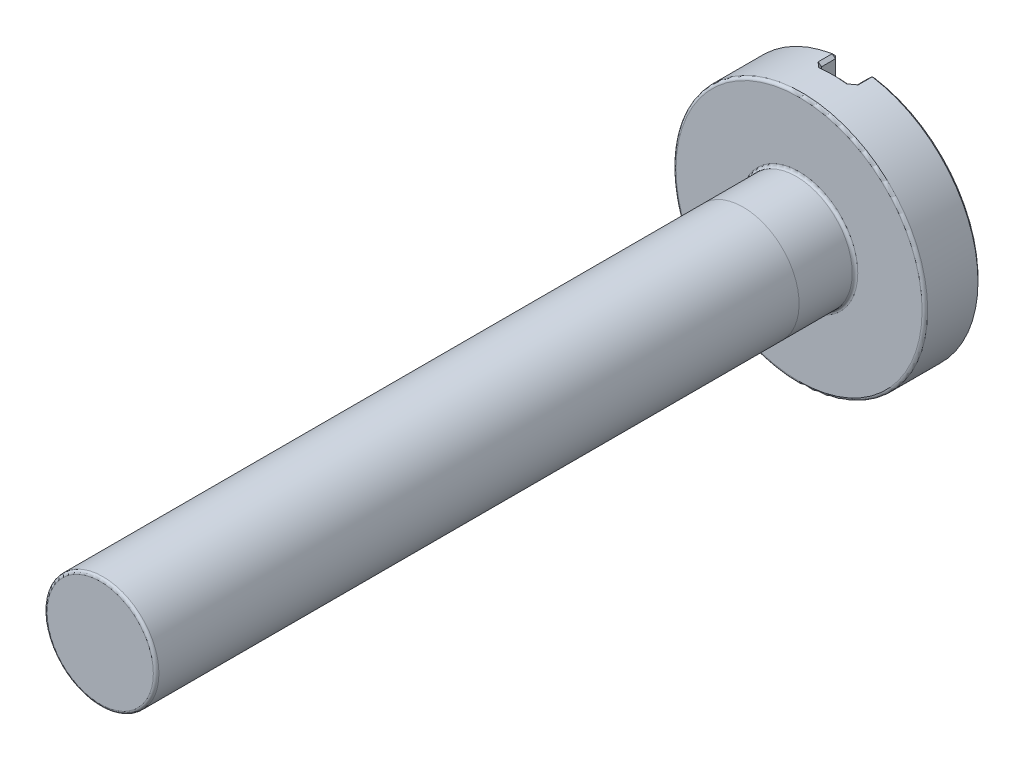
ISO-10303-21;
HEADER;
FILE_DESCRIPTION(('STEP AP214'),'2;1');
FILE_NAME('part.step','',(''),(''),'','','');
FILE_SCHEMA(('AUTOMOTIVE_DESIGN { 1 0 10303 214 1 1 1 1 }'));
ENDSEC;
DATA;
#1=APPLICATION_CONTEXT('core data for automotive mechanical design processes');
#2=APPLICATION_PROTOCOL_DEFINITION('international standard','automotive_design',2000,#1);
#3=PRODUCT_CONTEXT('',#1,'mechanical');
#4=PRODUCT('Part','Part','',(#3));
#5=PRODUCT_RELATED_PRODUCT_CATEGORY('part','',(#4));
#6=PRODUCT_DEFINITION_FORMATION('','',#4);
#7=PRODUCT_DEFINITION_CONTEXT('part definition',#1,'design');
#8=PRODUCT_DEFINITION('design','',#6,#7);
#9=PRODUCT_DEFINITION_SHAPE('','',#8);
#10=(LENGTH_UNIT() NAMED_UNIT(*) SI_UNIT(.MILLI.,.METRE.));
#11=(NAMED_UNIT(*) PLANE_ANGLE_UNIT() SI_UNIT($,.RADIAN.));
#12=(NAMED_UNIT(*) SI_UNIT($,.STERADIAN.) SOLID_ANGLE_UNIT());
#13=UNCERTAINTY_MEASURE_WITH_UNIT(LENGTH_MEASURE(1.E-05),#10,'distance_accuracy_value','');
#14=(GEOMETRIC_REPRESENTATION_CONTEXT(3) GLOBAL_UNCERTAINTY_ASSIGNED_CONTEXT((#13)) GLOBAL_UNIT_ASSIGNED_CONTEXT((#10,
#11,#12)) REPRESENTATION_CONTEXT('',''));
#15=CARTESIAN_POINT('',(0.,0.,0.));
#16=DIRECTION('',(0.,0.,1.));
#17=DIRECTION('',(1.,0.,0.));
#18=AXIS2_PLACEMENT_3D('',#15,#16,#17);
#19=CARTESIAN_POINT('',(0.,0.,12.5));
#20=DIRECTION('',(0.,0.,-1.));
#21=DIRECTION('',(-1.,0.,0.));
#22=AXIS2_PLACEMENT_3D('',#19,#20,#21);
#23=CYLINDRICAL_SURFACE('',#22,1.);
#24=CARTESIAN_POINT('',(0.,0.,12.45));
#25=DIRECTION('',(0.,0.,1.));
#26=DIRECTION('',(1.,0.,0.));
#27=AXIS2_PLACEMENT_3D('',#24,#25,#26);
#28=CIRCLE('',#27,1.);
#29=CARTESIAN_POINT('',(1.,0.,12.45));
#30=VERTEX_POINT('',#29);
#31=EDGE_CURVE('E55',#30,#30,#28,.F.);
#32=ORIENTED_EDGE('',*,*,#31,.T.);
#33=EDGE_LOOP('',(#32));
#34=FACE_BOUND('',#33,.T.);
#35=CARTESIAN_POINT('',(0.,0.,1.));
#36=DIRECTION('',(0.,0.,-1.));
#37=DIRECTION('',(0.,1.,0.));
#38=AXIS2_PLACEMENT_3D('',#35,#36,#37);
#39=CIRCLE('',#38,1.);
#40=CARTESIAN_POINT('',(0.,1.,1.));
#41=VERTEX_POINT('',#40);
#42=EDGE_CURVE('E11',#41,#41,#39,.T.);
#43=ORIENTED_EDGE('',*,*,#42,.F.);
#44=EDGE_LOOP('',(#43));
#45=FACE_BOUND('',#44,.T.);
#46=ADVANCED_FACE('F46',(#34,#45),#23,.T.);
#47=CARTESIAN_POINT('',(0.,0.,-1.));
#48=DIRECTION('',(0.,0.,1.));
#49=DIRECTION('',(1.,0.,0.));
#50=AXIS2_PLACEMENT_3D('',#47,#48,#49);
#51=CYLINDRICAL_SURFACE('',#50,2.25);
#52=CARTESIAN_POINT('',(0.,0.,-0.05));
#53=DIRECTION('',(0.,0.,1.));
#54=DIRECTION('',(1.,0.,0.));
#55=AXIS2_PLACEMENT_3D('',#52,#53,#54);
#56=CIRCLE('',#55,2.25);
#57=CARTESIAN_POINT('',(2.25,0.,-0.05));
#58=VERTEX_POINT('',#57);
#59=EDGE_CURVE('E514',#58,#58,#56,.F.);
#60=ORIENTED_EDGE('',*,*,#59,.T.);
#61=EDGE_LOOP('',(#60));
#62=FACE_BOUND('',#61,.T.);
#63=CARTESIAN_POINT('',(-0.357954545454545,2.22134385978138,-0.7));
#64=CARTESIAN_POINT('',(-0.349044313577281,2.22277959220945,-0.691081725524456));
#65=CARTESIAN_POINT('',(-0.340106008970925,2.22416500607063,-0.682183310951015));
#66=CARTESIAN_POINT('',(-0.322168315908917,2.22683406364462,-0.66443290328283));
#67=CARTESIAN_POINT('',(-0.313168927393422,2.2281177072577,-0.655580910233578));
#68=CARTESIAN_POINT('',(-0.288093679970526,2.2315384498966,-0.631080236997653));
#69=CARTESIAN_POINT('',(-0.271946710820839,2.23356468320811,-0.615488807873462));
#70=CARTESIAN_POINT('',(-0.255681818186013,2.23542541988267,-0.600000000002841));
#71=B_SPLINE_CURVE_WITH_KNOTS('',3,(#63,#64,#65,#66,#67,#68,#69,#70),.UNSPECIFIED.,.F.,.F.,(4,2,
2,4),(0.,0.0380643972705644,0.0761288318363076,0.143736873551843),.UNSPECIFIED.);
#72=CARTESIAN_POINT('',(-0.357954545454545,2.22134385978138,-0.7));
#73=VERTEX_POINT('',#72);
#74=CARTESIAN_POINT('',(-0.255681818181818,2.23542541988124,-0.6));
#75=VERTEX_POINT('',#74);
#76=EDGE_CURVE('E261',#73,#75,#71,.T.);
#77=ORIENTED_EDGE('',*,*,#76,.F.);
#78=DIRECTION('',(0.,0.,1.));
#79=VECTOR('',#78,1.);
#80=CARTESIAN_POINT('',(-0.357954545454545,2.22134385978138,-1.));
#81=LINE('',#80,#79);
#82=CARTESIAN_POINT('',(-0.357954545454545,2.22134385978138,-0.95));
#83=VERTEX_POINT('',#82);
#84=EDGE_CURVE('E259',#73,#83,#81,.F.);
#85=ORIENTED_EDGE('',*,*,#84,.T.);
#86=CARTESIAN_POINT('',(0.,0.,-0.95));
#87=DIRECTION('',(0.,0.,1.));
#88=DIRECTION('',(1.,0.,0.));
#89=AXIS2_PLACEMENT_3D('',#86,#87,#88);
#90=CIRCLE('',#89,2.25);
#91=CARTESIAN_POINT('',(-0.357954545454545,-2.22134385978138,-0.95));
#92=VERTEX_POINT('',#91);
#93=EDGE_CURVE('E255',#83,#92,#90,.T.);
#94=ORIENTED_EDGE('',*,*,#93,.T.);
#95=DIRECTION('',(0.,0.,1.));
#96=VECTOR('',#95,1.);
#97=CARTESIAN_POINT('',(-0.357954545454545,-2.22134385978138,-1.));
#98=LINE('',#97,#96);
#99=CARTESIAN_POINT('',(-0.357954545454545,-2.22134385978138,-0.7));
#100=VERTEX_POINT('',#99);
#101=EDGE_CURVE('E155',#92,#100,#98,.T.);
#102=ORIENTED_EDGE('',*,*,#101,.T.);
#103=CARTESIAN_POINT('',(-0.255681818181818,-2.23542541988124,-0.6));
#104=CARTESIAN_POINT('',(-0.264839427943543,-2.23437790052862,-0.608719796943994));
#105=CARTESIAN_POINT('',(-0.273959417330191,-2.23327784719118,-0.617472569925155));
#106=CARTESIAN_POINT('',(-0.29212937173172,-2.23097387990717,-0.635036917762392));
#107=CARTESIAN_POINT('',(-0.301179336862998,-2.22976996613328,-0.643848492520682));
#108=CARTESIAN_POINT('',(-0.326213414850236,-2.22628523492306,-0.668382417252336));
#109=CARTESIAN_POINT('',(-0.342127740146839,-2.22389382114135,-0.68416044499739));
#110=CARTESIAN_POINT('',(-0.357954545456661,-2.22134385978236,-0.700000000001358));
#111=B_SPLINE_CURVE_WITH_KNOTS('',3,(#103,#104,#105,#106,#107,#108,#109,#110),.UNSPECIFIED.,.F.,
.F.,(4,2,2,4),(0.,0.0380645508803724,0.0761290384749272,0.143736997088426),.UNSPECIFIED.);
#112=CARTESIAN_POINT('',(-0.255681818181818,-2.23542541988124,-0.6));
#113=VERTEX_POINT('',#112);
#114=EDGE_CURVE('E247',#113,#100,#111,.T.);
#115=ORIENTED_EDGE('',*,*,#114,.F.);
#116=CARTESIAN_POINT('',(0.,0.,-0.6));
#117=DIRECTION('',(0.,0.,-1.));
#118=DIRECTION('',(-1.,0.,0.));
#119=AXIS2_PLACEMENT_3D('',#116,#117,#118);
#120=CIRCLE('',#119,2.25);
#121=CARTESIAN_POINT('',(0.255681818181818,-2.23542541988124,-0.6));
#122=VERTEX_POINT('',#121);
#123=EDGE_CURVE('E203',#113,#122,#120,.F.);
#124=ORIENTED_EDGE('',*,*,#123,.T.);
#125=CARTESIAN_POINT('',(0.357954545454545,-2.22134385978138,-0.7));
#126=CARTESIAN_POINT('',(0.349044313577281,-2.22277959220945,-0.691081725524456));
#127=CARTESIAN_POINT('',(0.340106008970925,-2.22416500607063,-0.682183310951015));
#128=CARTESIAN_POINT('',(0.322168315908917,-2.22683406364462,-0.66443290328283));
#129=CARTESIAN_POINT('',(0.313168927393422,-2.2281177072577,-0.655580910233578));
#130=CARTESIAN_POINT('',(0.288093679970526,-2.2315384498966,-0.631080236997653));
#131=CARTESIAN_POINT('',(0.271946710820839,-2.23356468320811,-0.615488807873462));
#132=CARTESIAN_POINT('',(0.255681818186013,-2.23542541988267,-0.600000000002841));
#133=B_SPLINE_CURVE_WITH_KNOTS('',3,(#125,#126,#127,#128,#129,#130,#131,#132),.UNSPECIFIED.,.F.,
.F.,(4,2,2,4),(0.,0.0380643972705644,0.0761288318363076,0.143736873551843),.UNSPECIFIED.);
#134=CARTESIAN_POINT('',(0.357954545454545,-2.22134385978138,-0.7));
#135=VERTEX_POINT('',#134);
#136=EDGE_CURVE('E194',#135,#122,#133,.T.);
#137=ORIENTED_EDGE('',*,*,#136,.F.);
#138=DIRECTION('',(0.,0.,1.));
#139=VECTOR('',#138,1.);
#140=CARTESIAN_POINT('',(0.357954545454545,-2.22134385978138,-1.));
#141=LINE('',#140,#139);
#142=CARTESIAN_POINT('',(0.357954545454545,-2.22134385978138,-0.95));
#143=VERTEX_POINT('',#142);
#144=EDGE_CURVE('E192',#135,#143,#141,.F.);
#145=ORIENTED_EDGE('',*,*,#144,.T.);
#146=CARTESIAN_POINT('',(0.,0.,-0.95));
#147=DIRECTION('',(0.,0.,1.));
#148=DIRECTION('',(1.,0.,0.));
#149=AXIS2_PLACEMENT_3D('',#146,#147,#148);
#150=CIRCLE('',#149,2.25);
#151=CARTESIAN_POINT('',(0.357954545454545,2.22134385978138,-0.95));
#152=VERTEX_POINT('',#151);
#153=EDGE_CURVE('E185',#143,#152,#150,.T.);
#154=ORIENTED_EDGE('',*,*,#153,.T.);
#155=DIRECTION('',(0.,0.,1.));
#156=VECTOR('',#155,1.);
#157=CARTESIAN_POINT('',(0.357954545454545,2.22134385978138,-1.));
#158=LINE('',#157,#156);
#159=CARTESIAN_POINT('',(0.357954545454545,2.22134385978138,-0.7));
#160=VERTEX_POINT('',#159);
#161=EDGE_CURVE('E190',#152,#160,#158,.T.);
#162=ORIENTED_EDGE('',*,*,#161,.T.);
#163=CARTESIAN_POINT('',(0.255681818181818,2.23542541988124,-0.6));
#164=CARTESIAN_POINT('',(0.264839427943543,2.23437790052862,-0.608719796943994));
#165=CARTESIAN_POINT('',(0.273959417330191,2.23327784719118,-0.617472569925155));
#166=CARTESIAN_POINT('',(0.29212937173172,2.23097387990717,-0.635036917762392));
#167=CARTESIAN_POINT('',(0.301179336862998,2.22976996613328,-0.643848492520682));
#168=CARTESIAN_POINT('',(0.326213414850236,2.22628523492306,-0.668382417252336));
#169=CARTESIAN_POINT('',(0.342127740146839,2.22389382114135,-0.68416044499739));
#170=CARTESIAN_POINT('',(0.357954545456661,2.22134385978236,-0.700000000001358));
#171=B_SPLINE_CURVE_WITH_KNOTS('',3,(#163,#164,#165,#166,#167,#168,#169,#170),.UNSPECIFIED.,.F.,
.F.,(4,2,2,4),(0.,0.0380645508803724,0.0761290384749272,0.143736997088426),.UNSPECIFIED.);
#172=CARTESIAN_POINT('',(0.255681818181818,2.23542541988124,-0.6));
#173=VERTEX_POINT('',#172);
#174=EDGE_CURVE('E240',#173,#160,#171,.T.);
#175=ORIENTED_EDGE('',*,*,#174,.F.);
#176=CARTESIAN_POINT('',(0.,0.,-0.6));
#177=DIRECTION('',(0.,0.,-1.));
#178=DIRECTION('',(-1.,0.,0.));
#179=AXIS2_PLACEMENT_3D('',#176,#177,#178);
#180=CIRCLE('',#179,2.25);
#181=EDGE_CURVE('E257',#173,#75,#180,.F.);
#182=ORIENTED_EDGE('',*,*,#181,.T.);
#183=EDGE_LOOP('',(#77,#85,#94,#102,#115,#124,#137,#145,#154,#162,#175,#182));
#184=FACE_BOUND('',#183,.T.);
#185=ADVANCED_FACE('F205',(#62,#184),#51,.T.);
#186=CARTESIAN_POINT('',(0.,0.,-1.));
#187=DIRECTION('',(0.,0.,1.));
#188=DIRECTION('',(1.,0.,0.));
#189=AXIS2_PLACEMENT_3D('',#186,#187,#188);
#190=PLANE('',#189);
#191=CARTESIAN_POINT('',(0.,0.,-1.));
#192=DIRECTION('',(0.,0.,1.));
#193=DIRECTION('',(1.,0.,0.));
#194=AXIS2_PLACEMENT_3D('',#191,#192,#193);
#195=CIRCLE('',#194,2.2);
#196=CARTESIAN_POINT('',(0.35,2.17198066289735,-1.));
#197=VERTEX_POINT('',#196);
#198=CARTESIAN_POINT('',(0.35,-2.17198066289735,-1.));
#199=VERTEX_POINT('',#198);
#200=EDGE_CURVE('E61',#197,#199,#195,.F.);
#201=ORIENTED_EDGE('',*,*,#200,.T.);
#202=DIRECTION('',(0.,1.,0.));
#203=VECTOR('',#202,1.);
#204=CARTESIAN_POINT('',(0.35,0.,-1.));
#205=LINE('',#204,#203);
#206=EDGE_CURVE('E530',#199,#197,#205,.T.);
#207=ORIENTED_EDGE('',*,*,#206,.T.);
#208=EDGE_LOOP('',(#201,#207));
#209=FACE_BOUND('',#208,.T.);
#210=ADVANCED_FACE('F494',(#209),#190,.F.);
#211=ORIENTED_EDGE('',*,*,#42,.T.);
#212=EDGE_LOOP('',(#211));
#213=FACE_BOUND('',#212,.T.);
#214=CARTESIAN_POINT('',(0.,0.,0.0499999999999997));
#215=DIRECTION('',(0.,0.,1.));
#216=DIRECTION('',(1.,0.,0.));
#217=AXIS2_PLACEMENT_3D('',#214,#215,#216);
#218=CIRCLE('',#217,1.);
#219=CARTESIAN_POINT('',(1.,0.,0.0499999999999997));
#220=VERTEX_POINT('',#219);
#221=EDGE_CURVE('E512',#220,#220,#218,.T.);
#222=ORIENTED_EDGE('',*,*,#221,.T.);
#223=EDGE_LOOP('',(#222));
#224=FACE_BOUND('',#223,.T.);
#225=ADVANCED_FACE('F218',(#213,#224),#23,.T.);
#226=CARTESIAN_POINT('',(0.,0.,12.5));
#227=DIRECTION('',(0.,0.,1.));
#228=DIRECTION('',(1.,0.,0.));
#229=AXIS2_PLACEMENT_3D('',#226,#227,#228);
#230=PLANE('',#229);
#231=CARTESIAN_POINT('',(0.,0.,12.5));
#232=DIRECTION('',(0.,0.,1.));
#233=DIRECTION('',(1.,0.,0.));
#234=AXIS2_PLACEMENT_3D('',#231,#232,#233);
#235=CIRCLE('',#234,0.95);
#236=CARTESIAN_POINT('',(0.95,0.,12.5));
#237=VERTEX_POINT('',#236);
#238=EDGE_CURVE('E513',#237,#237,#235,.T.);
#239=ORIENTED_EDGE('',*,*,#238,.T.);
#240=EDGE_LOOP('',(#239));
#241=FACE_BOUND('',#240,.T.);
#242=ADVANCED_FACE('F499',(#241),#230,.T.);
#243=CARTESIAN_POINT('',(0.,0.,-1.));
#244=DIRECTION('',(0.,0.,1.));
#245=DIRECTION('',(1.,0.,0.));
#246=AXIS2_PLACEMENT_3D('',#243,#244,#245);
#247=CIRCLE('',#246,2.2);
#248=CARTESIAN_POINT('',(-0.35,-2.17198066289735,-1.));
#249=VERTEX_POINT('',#248);
#250=CARTESIAN_POINT('',(-0.35,2.17198066289735,-1.));
#251=VERTEX_POINT('',#250);
#252=EDGE_CURVE('E593',#249,#251,#247,.F.);
#253=ORIENTED_EDGE('',*,*,#252,.T.);
#254=DIRECTION('',(0.,-1.,0.));
#255=VECTOR('',#254,1.);
#256=CARTESIAN_POINT('',(-0.35,0.,-1.));
#257=LINE('',#256,#255);
#258=EDGE_CURVE('E600',#251,#249,#257,.T.);
#259=ORIENTED_EDGE('',*,*,#258,.T.);
#260=EDGE_LOOP('',(#253,#259));
#261=FACE_BOUND('',#260,.T.);
#262=ADVANCED_FACE('F505',(#261),#190,.F.);
#263=CARTESIAN_POINT('',(0.,0.,0.));
#264=DIRECTION('',(0.,0.,1.));
#265=DIRECTION('',(1.,0.,0.));
#266=AXIS2_PLACEMENT_3D('',#263,#264,#265);
#267=PLANE('',#266);
#268=CARTESIAN_POINT('',(0.,0.,0.));
#269=DIRECTION('',(0.,0.,1.));
#270=DIRECTION('',(1.,0.,0.));
#271=AXIS2_PLACEMENT_3D('',#268,#269,#270);
#272=CIRCLE('',#271,2.2);
#273=CARTESIAN_POINT('',(2.2,0.,0.));
#274=VERTEX_POINT('',#273);
#275=EDGE_CURVE('E519',#274,#274,#272,.T.);
#276=ORIENTED_EDGE('',*,*,#275,.T.);
#277=EDGE_LOOP('',(#276));
#278=FACE_BOUND('',#277,.T.);
#279=CARTESIAN_POINT('',(0.,0.,0.));
#280=DIRECTION('',(0.,0.,1.));
#281=DIRECTION('',(1.,0.,0.));
#282=AXIS2_PLACEMENT_3D('',#279,#280,#281);
#283=CIRCLE('',#282,1.05);
#284=CARTESIAN_POINT('',(1.05,0.,0.));
#285=VERTEX_POINT('',#284);
#286=EDGE_CURVE('E527',#285,#285,#283,.F.);
#287=ORIENTED_EDGE('',*,*,#286,.T.);
#288=EDGE_LOOP('',(#287));
#289=FACE_BOUND('',#288,.T.);
#290=ADVANCED_FACE('F617',(#278,#289),#267,.T.);
#291=CARTESIAN_POINT('',(0.3,-3.72872824867462,-0.65));
#292=DIRECTION('',(1.,0.,0.));
#293=DIRECTION('',(0.,0.,-1.));
#294=AXIS2_PLACEMENT_3D('',#291,#292,#293);
#295=PLANE('',#294);
#296=DIRECTION('',(0.,0.,1.));
#297=VECTOR('',#296,1.);
#298=CARTESIAN_POINT('',(0.3,-2.17198066289735,-0.65));
#299=LINE('',#298,#297);
#300=CARTESIAN_POINT('',(0.3,-2.17198066289735,-0.95));
#301=VERTEX_POINT('',#300);
#302=CARTESIAN_POINT('',(0.3,-2.17198066289735,-0.7));
#303=VERTEX_POINT('',#302);
#304=EDGE_CURVE('E554',#301,#303,#299,.T.);
#305=ORIENTED_EDGE('',*,*,#304,.T.);
#306=DIRECTION('',(0.,1.,0.));
#307=VECTOR('',#306,1.);
#308=CARTESIAN_POINT('',(0.3,-3.72872824867462,-0.7));
#309=LINE('',#308,#307);
#310=CARTESIAN_POINT('',(0.3,2.17198066289735,-0.7));
#311=VERTEX_POINT('',#310);
#312=EDGE_CURVE('E955',#303,#311,#309,.T.);
#313=ORIENTED_EDGE('',*,*,#312,.T.);
#314=DIRECTION('',(0.,0.,-1.));
#315=VECTOR('',#314,1.);
#316=CARTESIAN_POINT('',(0.3,2.17198066289735,-1.));
#317=LINE('',#316,#315);
#318=CARTESIAN_POINT('',(0.3,2.17198066289735,-0.95));
#319=VERTEX_POINT('',#318);
#320=EDGE_CURVE('E958',#311,#319,#317,.T.);
#321=ORIENTED_EDGE('',*,*,#320,.T.);
#322=DIRECTION('',(0.,-1.,0.));
#323=VECTOR('',#322,1.);
#324=CARTESIAN_POINT('',(0.3,-3.72872824867462,-0.95));
#325=LINE('',#324,#323);
#326=EDGE_CURVE('E268',#319,#301,#325,.T.);
#327=ORIENTED_EDGE('',*,*,#326,.T.);
#328=EDGE_LOOP('',(#305,#313,#321,#327));
#329=FACE_BOUND('',#328,.T.);
#330=ADVANCED_FACE('F621',(#329),#295,.F.);
#331=CARTESIAN_POINT('',(-0.3,-3.72872824867462,-0.65));
#332=DIRECTION('',(-1.,0.,0.));
#333=DIRECTION('',(0.,0.,1.));
#334=AXIS2_PLACEMENT_3D('',#331,#332,#333);
#335=PLANE('',#334);
#336=DIRECTION('',(0.,0.,1.));
#337=VECTOR('',#336,1.);
#338=CARTESIAN_POINT('',(-0.3,2.17198066289735,-0.65));
#339=LINE('',#338,#337);
#340=CARTESIAN_POINT('',(-0.3,2.17198066289735,-0.95));
#341=VERTEX_POINT('',#340);
#342=CARTESIAN_POINT('',(-0.3,2.17198066289735,-0.7));
#343=VERTEX_POINT('',#342);
#344=EDGE_CURVE('E177',#341,#343,#339,.T.);
#345=ORIENTED_EDGE('',*,*,#344,.T.);
#346=DIRECTION('',(0.,-1.,0.));
#347=VECTOR('',#346,1.);
#348=CARTESIAN_POINT('',(-0.3,-3.72872824867462,-0.7));
#349=LINE('',#348,#347);
#350=CARTESIAN_POINT('',(-0.3,-2.17198066289735,-0.7));
#351=VERTEX_POINT('',#350);
#352=EDGE_CURVE('E182',#343,#351,#349,.T.);
#353=ORIENTED_EDGE('',*,*,#352,.T.);
#354=DIRECTION('',(0.,0.,-1.));
#355=VECTOR('',#354,1.);
#356=CARTESIAN_POINT('',(-0.3,-2.17198066289735,-1.));
#357=LINE('',#356,#355);
#358=CARTESIAN_POINT('',(-0.3,-2.17198066289735,-0.95));
#359=VERTEX_POINT('',#358);
#360=EDGE_CURVE('E153',#351,#359,#357,.T.);
#361=ORIENTED_EDGE('',*,*,#360,.T.);
#362=DIRECTION('',(0.,1.,0.));
#363=VECTOR('',#362,1.);
#364=CARTESIAN_POINT('',(-0.3,-3.72872824867462,-0.95));
#365=LINE('',#364,#363);
#366=EDGE_CURVE('E171',#359,#341,#365,.T.);
#367=ORIENTED_EDGE('',*,*,#366,.T.);
#368=EDGE_LOOP('',(#345,#353,#361,#367));
#369=FACE_BOUND('',#368,.T.);
#370=ADVANCED_FACE('F180',(#369),#335,.F.);
#371=CARTESIAN_POINT('',(0.,0.,-0.65));
#372=DIRECTION('',(0.,0.,-1.));
#373=DIRECTION('',(-1.,0.,0.));
#374=AXIS2_PLACEMENT_3D('',#371,#372,#373);
#375=PLANE('',#374);
#376=DIRECTION('',(0.,-1.,0.));
#377=VECTOR('',#376,1.);
#378=CARTESIAN_POINT('',(0.25,0.,-0.65));
#379=LINE('',#378,#377);
#380=CARTESIAN_POINT('',(0.25,2.18574929943944,-0.65));
#381=VERTEX_POINT('',#380);
#382=CARTESIAN_POINT('',(0.25,-2.18574929943944,-0.65));
#383=VERTEX_POINT('',#382);
#384=EDGE_CURVE('E590',#381,#383,#379,.T.);
#385=ORIENTED_EDGE('',*,*,#384,.T.);
#386=CARTESIAN_POINT('',(0.,0.,-0.65));
#387=DIRECTION('',(0.,0.,-1.));
#388=DIRECTION('',(-1.,0.,0.));
#389=AXIS2_PLACEMENT_3D('',#386,#387,#388);
#390=CIRCLE('',#389,2.2);
#391=CARTESIAN_POINT('',(-0.25,-2.18574929943944,-0.65));
#392=VERTEX_POINT('',#391);
#393=EDGE_CURVE('E569',#383,#392,#390,.T.);
#394=ORIENTED_EDGE('',*,*,#393,.T.);
#395=DIRECTION('',(0.,1.,0.));
#396=VECTOR('',#395,1.);
#397=CARTESIAN_POINT('',(-0.25,0.,-0.65));
#398=LINE('',#397,#396);
#399=CARTESIAN_POINT('',(-0.25,2.18574929943944,-0.65));
#400=VERTEX_POINT('',#399);
#401=EDGE_CURVE('E595',#392,#400,#398,.T.);
#402=ORIENTED_EDGE('',*,*,#401,.T.);
#403=CARTESIAN_POINT('',(0.,0.,-0.65));
#404=DIRECTION('',(0.,0.,-1.));
#405=DIRECTION('',(-1.,0.,0.));
#406=AXIS2_PLACEMENT_3D('',#403,#404,#405);
#407=CIRCLE('',#406,2.2);
#408=EDGE_CURVE('E587',#400,#381,#407,.T.);
#409=ORIENTED_EDGE('',*,*,#408,.T.);
#410=EDGE_LOOP('',(#385,#394,#402,#409));
#411=FACE_BOUND('',#410,.T.);
#412=ADVANCED_FACE('F476',(#411),#375,.T.);
#413=CARTESIAN_POINT('',(0.3,2.17198066289735,-0.95));
#414=DIRECTION('',(-0.544058820349419,0.638748776906851,-0.544058820349419));
#415=DIRECTION('',(0.,0.648424664440325,0.761278828383827));
#416=AXIS2_PLACEMENT_3D('',#413,#414,#415);
#417=PLANE('',#416);
#418=DIRECTION('',(0.761278828383827,0.648424664440324,0.));
#419=VECTOR('',#418,1.);
#420=CARTESIAN_POINT('',(0.3,2.17198066289735,-0.95));
#421=LINE('',#420,#419);
#422=EDGE_CURVE('E535',#152,#319,#421,.F.);
#423=ORIENTED_EDGE('',*,*,#422,.F.);
#424=DIRECTION('',(-0.112494260643311,-0.698101025154894,-0.707106781186548));
#425=VECTOR('',#424,1.);
#426=CARTESIAN_POINT('',(0.,0.,-3.2));
#427=LINE('',#426,#425);
#428=EDGE_CURVE('E178',#197,#152,#427,.F.);
#429=ORIENTED_EDGE('',*,*,#428,.F.);
#430=DIRECTION('',(0.707106781186547,0.,-0.707106781186547));
#431=VECTOR('',#430,1.);
#432=CARTESIAN_POINT('',(0.3,2.17198066289735,-0.95));
#433=LINE('',#432,#431);
#434=EDGE_CURVE('E532',#319,#197,#433,.T.);
#435=ORIENTED_EDGE('',*,*,#434,.F.);
#436=EDGE_LOOP('',(#423,#429,#435));
#437=FACE_BOUND('',#436,.T.);
#438=ADVANCED_FACE('F471',(#437),#417,.T.);
#439=CARTESIAN_POINT('',(0.,0.,-0.95));
#440=DIRECTION('',(0.,0.,1.));
#441=DIRECTION('',(1.,0.,0.));
#442=AXIS2_PLACEMENT_3D('',#439,#440,#441);
#443=CONICAL_SURFACE('',#442,2.25,0.785398163397448);
#444=ORIENTED_EDGE('',*,*,#428,.T.);
#445=ORIENTED_EDGE('',*,*,#153,.F.);
#446=DIRECTION('',(0.112494260643311,-0.698101025154894,0.707106781186548));
#447=VECTOR('',#446,1.);
#448=CARTESIAN_POINT('',(0.,0.,-3.2));
#449=LINE('',#448,#447);
#450=EDGE_CURVE('E538',#199,#143,#449,.T.);
#451=ORIENTED_EDGE('',*,*,#450,.F.);
#452=ORIENTED_EDGE('',*,*,#200,.F.);
#453=EDGE_LOOP('',(#444,#445,#451,#452));
#454=FACE_BOUND('',#453,.T.);
#455=ADVANCED_FACE('F465',(#454),#443,.T.);
#456=CARTESIAN_POINT('',(0.35,0.,-1.));
#457=DIRECTION('',(0.707106781186548,0.,0.707106781186548));
#458=DIRECTION('',(0.,1.,0.));
#459=AXIS2_PLACEMENT_3D('',#456,#457,#458);
#460=PLANE('',#459);
#461=ORIENTED_EDGE('',*,*,#434,.T.);
#462=ORIENTED_EDGE('',*,*,#206,.F.);
#463=DIRECTION('',(-0.707106781186547,0.,0.707106781186547));
#464=VECTOR('',#463,1.);
#465=CARTESIAN_POINT('',(0.328977272727272,-2.17198066289735,-0.978977272727273));
#466=LINE('',#465,#464);
#467=EDGE_CURVE('E541',#301,#199,#466,.F.);
#468=ORIENTED_EDGE('',*,*,#467,.F.);
#469=ORIENTED_EDGE('',*,*,#326,.F.);
#470=EDGE_LOOP('',(#461,#462,#468,#469));
#471=FACE_BOUND('',#470,.T.);
#472=ADVANCED_FACE('F458',(#471),#460,.F.);
#473=CARTESIAN_POINT('',(0.3,2.17198066289735,-1.));
#474=DIRECTION('',(-0.648424664440325,0.761278828383827,0.));
#475=DIRECTION('',(0.,0.,1.));
#476=AXIS2_PLACEMENT_3D('',#473,#474,#475);
#477=PLANE('',#476);
#478=ORIENTED_EDGE('',*,*,#422,.T.);
#479=ORIENTED_EDGE('',*,*,#320,.F.);
#480=DIRECTION('',(-0.761278828383827,-0.648424664440325,0.));
#481=VECTOR('',#480,1.);
#482=CARTESIAN_POINT('',(0.357954545454545,2.22134385978138,-0.7));
#483=LINE('',#482,#481);
#484=EDGE_CURVE('E543',#160,#311,#483,.T.);
#485=ORIENTED_EDGE('',*,*,#484,.F.);
#486=ORIENTED_EDGE('',*,*,#161,.F.);
#487=EDGE_LOOP('',(#478,#479,#485,#486));
#488=FACE_BOUND('',#487,.T.);
#489=ADVANCED_FACE('F451',(#488),#477,.T.);
#490=CARTESIAN_POINT('',(0.357954545454545,-2.22134385978138,-0.95));
#491=DIRECTION('',(-0.544058820349419,-0.638748776906851,-0.544058820349419));
#492=DIRECTION('',(0.,0.648424664440325,-0.761278828383827));
#493=AXIS2_PLACEMENT_3D('',#490,#491,#492);
#494=PLANE('',#493);
#495=ORIENTED_EDGE('',*,*,#467,.T.);
#496=ORIENTED_EDGE('',*,*,#450,.T.);
#497=DIRECTION('',(0.761278828383827,-0.648424664440324,0.));
#498=VECTOR('',#497,1.);
#499=CARTESIAN_POINT('',(0.357954545454545,-2.22134385978138,-0.95));
#500=LINE('',#499,#498);
#501=EDGE_CURVE('E406',#301,#143,#500,.T.);
#502=ORIENTED_EDGE('',*,*,#501,.F.);
#503=EDGE_LOOP('',(#495,#496,#502));
#504=FACE_BOUND('',#503,.T.);
#505=ADVANCED_FACE('F439',(#504),#494,.T.);
#506=CARTESIAN_POINT('',(0.25,2.18574929943944,-0.65));
#507=CARTESIAN_POINT('',(0.3,2.17198066289735,-0.7));
#508=CARTESIAN_POINT('',(0.255681818181818,2.23542541988124,-0.6));
#509=CARTESIAN_POINT('',(0.357954545454545,2.22134385978138,-0.7));
#510=CARTESIAN_POINT('',(0.255780939635302,2.23629203847129,-0.599127731209342));
#511=CARTESIAN_POINT('',(0.35896558428008,2.22220501930236,-0.7));
#512=B_SPLINE_SURFACE_WITH_KNOTS('',1,1,((#506,#507),(#508,#509),(#510,#511)),.UNSPECIFIED.,.F.,
.F.,.F.,(2,1,2),(2,2),(0.,1.,1.01744537581316),(0.,1.),.UNSPECIFIED.);
#513=CARTESIAN_POINT('',(0.3,2.17198066289735,-0.7));
#514=CARTESIAN_POINT('',(0.295596818382361,2.17319317904379,-0.695596818382361));
#515=CARTESIAN_POINT('',(0.291193636764722,2.17440569519023,-0.691193636764721));
#516=CARTESIAN_POINT('',(0.282387273529444,2.17683072748312,-0.682387273529443));
#517=CARTESIAN_POINT('',(0.277984091911805,2.17804324362956,-0.677984091911804));
#518=CARTESIAN_POINT('',(0.265720606862777,2.18142027299715,-0.665720606862777));
#519=CARTESIAN_POINT('',(0.257860303431389,2.18358478621829,-0.657860303431388));
#520=CARTESIAN_POINT('',(0.25,2.18574929943944,-0.65));
#521=B_SPLINE_CURVE_WITH_KNOTS('',3,(#513,#514,#515,#516,#517,#518,#519,#520),.UNSPECIFIED.,.F.,
.F.,(4,2,2,4),(0.,0.0190319707095956,0.0380639414191913,0.0720387073192474),.UNSPECIFIED.);
#522=EDGE_CURVE('E397',#381,#311,#521,.F.);
#523=DIRECTION('',(0.0803530433166526,0.702526432548803,0.70710678118655));
#524=VECTOR('',#523,1.);
#525=CARTESIAN_POINT('',(0.25,2.18574929943944,-0.65));
#526=LINE('',#525,#524);
#527=EDGE_CURVE('E407',#173,#381,#526,.F.);
#528=ORIENTED_EDGE('',*,*,#174,.T.);
#529=ORIENTED_EDGE('',*,*,#484,.T.);
#530=ORIENTED_EDGE('',*,*,#522,.F.);
#531=ORIENTED_EDGE('',*,*,#527,.F.);
#532=EDGE_LOOP('',(#528,#529,#530,#531));
#533=FACE_BOUND('',#532,.T.);
#534=ADVANCED_FACE('F430',(#533),#512,.T.);
#535=CARTESIAN_POINT('',(0.3,-2.17198066289735,-1.));
#536=DIRECTION('',(0.648424664440325,0.761278828383827,0.));
#537=DIRECTION('',(0.,0.,1.));
#538=AXIS2_PLACEMENT_3D('',#535,#536,#537);
#539=PLANE('',#538);
#540=ORIENTED_EDGE('',*,*,#501,.T.);
#541=ORIENTED_EDGE('',*,*,#144,.F.);
#542=DIRECTION('',(0.761278828383827,-0.648424664440325,0.));
#543=VECTOR('',#542,1.);
#544=CARTESIAN_POINT('',(0.3,-2.17198066289735,-0.7));
#545=LINE('',#544,#543);
#546=EDGE_CURVE('E565',#303,#135,#545,.T.);
#547=ORIENTED_EDGE('',*,*,#546,.F.);
#548=ORIENTED_EDGE('',*,*,#304,.F.);
#549=EDGE_LOOP('',(#540,#541,#547,#548));
#550=FACE_BOUND('',#549,.T.);
#551=ADVANCED_FACE('F381',(#550),#539,.F.);
#552=CARTESIAN_POINT('',(0.25,0.,-0.65));
#553=DIRECTION('',(0.707106781186548,0.,0.707106781186548));
#554=DIRECTION('',(0.,-1.,0.));
#555=AXIS2_PLACEMENT_3D('',#552,#553,#554);
#556=PLANE('',#555);
#557=ORIENTED_EDGE('',*,*,#522,.T.);
#558=ORIENTED_EDGE('',*,*,#312,.F.);
#559=CARTESIAN_POINT('',(0.25,-2.18574929943944,-0.65));
#560=CARTESIAN_POINT('',(0.254403181617639,-2.184536783293,-0.654403181617639));
#561=CARTESIAN_POINT('',(0.258806363235278,-2.18332426714656,-0.658806363235278));
#562=CARTESIAN_POINT('',(0.267612726470557,-2.18089923485367,-0.667612726470556));
#563=CARTESIAN_POINT('',(0.272015908088196,-2.17968671870723,-0.672015908088195));
#564=CARTESIAN_POINT('',(0.284279393137223,-2.17630968933964,-0.684279393137223));
#565=CARTESIAN_POINT('',(0.292139696568611,-2.1741451761185,-0.692139696568611));
#566=CARTESIAN_POINT('',(0.3,-2.17198066289735,-0.7));
#567=B_SPLINE_CURVE_WITH_KNOTS('',3,(#559,#560,#561,#562,#563,#564,#565,#566),.UNSPECIFIED.,.F.,
.F.,(4,2,2,4),(0.,0.0190319707095956,0.0380639414191912,0.0720387073192474),.UNSPECIFIED.);
#568=EDGE_CURVE('E389',#383,#303,#567,.T.);
#569=ORIENTED_EDGE('',*,*,#568,.F.);
#570=ORIENTED_EDGE('',*,*,#384,.F.);
#571=EDGE_LOOP('',(#557,#558,#569,#570));
#572=FACE_BOUND('',#571,.T.);
#573=ADVANCED_FACE('F368',(#572),#556,.F.);
#574=CARTESIAN_POINT('',(0.,0.,-0.6));
#575=DIRECTION('',(0.,0.,1.));
#576=DIRECTION('',(1.,0.,0.));
#577=AXIS2_PLACEMENT_3D('',#574,#575,#576);
#578=CONICAL_SURFACE('',#577,2.25,0.785398163397448);
#579=ORIENTED_EDGE('',*,*,#527,.T.);
#580=ORIENTED_EDGE('',*,*,#408,.F.);
#581=DIRECTION('',(0.0803530433166526,-0.702526432548803,-0.70710678118655));
#582=VECTOR('',#581,1.);
#583=CARTESIAN_POINT('',(-0.255681818181818,2.23542541988124,-0.6));
#584=LINE('',#583,#582);
#585=EDGE_CURVE('E576',#75,#400,#584,.T.);
#586=ORIENTED_EDGE('',*,*,#585,.F.);
#587=ORIENTED_EDGE('',*,*,#181,.F.);
#588=EDGE_LOOP('',(#579,#580,#586,#587));
#589=FACE_BOUND('',#588,.T.);
#590=ADVANCED_FACE('F380',(#589),#578,.T.);
#591=CARTESIAN_POINT('',(-0.3,2.17198066289735,-1.));
#592=DIRECTION('',(-0.648424664440325,-0.761278828383827,0.));
#593=DIRECTION('',(0.,0.,1.));
#594=AXIS2_PLACEMENT_3D('',#591,#592,#593);
#595=PLANE('',#594);
#596=DIRECTION('',(-0.761278828383827,0.648424664440324,0.));
#597=VECTOR('',#596,1.);
#598=CARTESIAN_POINT('',(-0.357954545454545,2.22134385978138,-0.95));
#599=LINE('',#598,#597);
#600=EDGE_CURVE('E570',#83,#341,#599,.F.);
#601=ORIENTED_EDGE('',*,*,#600,.F.);
#602=ORIENTED_EDGE('',*,*,#84,.F.);
#603=DIRECTION('',(-0.761278828383827,0.648424664440325,0.));
#604=VECTOR('',#603,1.);
#605=CARTESIAN_POINT('',(-0.3,2.17198066289735,-0.7));
#606=LINE('',#605,#604);
#607=EDGE_CURVE('E572',#343,#73,#606,.T.);
#608=ORIENTED_EDGE('',*,*,#607,.F.);
#609=ORIENTED_EDGE('',*,*,#344,.F.);
#610=EDGE_LOOP('',(#601,#602,#608,#609));
#611=FACE_BOUND('',#610,.T.);
#612=ADVANCED_FACE('F672',(#611),#595,.F.);
#613=CARTESIAN_POINT('',(0.3,-2.17198066289735,-0.7));
#614=CARTESIAN_POINT('',(0.25,-2.18574929943944,-0.65));
#615=CARTESIAN_POINT('',(0.357954545454545,-2.22134385978138,-0.7));
#616=CARTESIAN_POINT('',(0.255681818181818,-2.23542541988124,-0.6));
#617=CARTESIAN_POINT('',(0.358954514606664,-2.22219559062918,-0.7));
#618=CARTESIAN_POINT('',(0.255779854373203,-2.2362825500278,-0.599137281515819));
#619=B_SPLINE_SURFACE_WITH_KNOTS('',1,1,((#613,#614),(#615,#616),(#617,#618)),.UNSPECIFIED.,.F.,
.F.,.F.,(2,1,2),(2,2),(0.,1.,1.01725436968363),(0.,1.),.UNSPECIFIED.);
#620=DIRECTION('',(-0.0803530433166526,0.702526432548803,-0.70710678118655));
#621=VECTOR('',#620,1.);
#622=CARTESIAN_POINT('',(0.255681818181818,-2.23542541988124,-0.6));
#623=LINE('',#622,#621);
#624=EDGE_CURVE('E326',#383,#122,#623,.F.);
#625=ORIENTED_EDGE('',*,*,#546,.T.);
#626=ORIENTED_EDGE('',*,*,#136,.T.);
#627=ORIENTED_EDGE('',*,*,#624,.F.);
#628=ORIENTED_EDGE('',*,*,#568,.T.);
#629=EDGE_LOOP('',(#625,#626,#627,#628));
#630=FACE_BOUND('',#629,.T.);
#631=ADVANCED_FACE('F366',(#630),#619,.T.);
#632=CARTESIAN_POINT('',(-0.3,2.17198066289735,-0.7));
#633=CARTESIAN_POINT('',(-0.25,2.18574929943944,-0.65));
#634=CARTESIAN_POINT('',(-0.357954545454545,2.22134385978138,-0.7));
#635=CARTESIAN_POINT('',(-0.255681818181818,2.23542541988124,-0.6));
#636=CARTESIAN_POINT('',(-0.358954514606664,2.22219559062918,-0.7));
#637=CARTESIAN_POINT('',(-0.255779854373203,2.2362825500278,-0.599137281515819));
#638=B_SPLINE_SURFACE_WITH_KNOTS('',1,1,((#632,#633),(#634,#635),(#636,#637)),.UNSPECIFIED.,.F.,
.F.,.F.,(2,1,2),(2,2),(0.,1.,1.01725436968363),(0.,1.),.UNSPECIFIED.);
#639=CARTESIAN_POINT('',(-0.25,2.18574929943944,-0.65));
#640=CARTESIAN_POINT('',(-0.254403181617639,2.184536783293,-0.654403181617639));
#641=CARTESIAN_POINT('',(-0.258806363235278,2.18332426714656,-0.658806363235278));
#642=CARTESIAN_POINT('',(-0.267612726470557,2.18089923485367,-0.667612726470556));
#643=CARTESIAN_POINT('',(-0.272015908088196,2.17968671870723,-0.672015908088195));
#644=CARTESIAN_POINT('',(-0.284279393137223,2.17630968933964,-0.684279393137223));
#645=CARTESIAN_POINT('',(-0.292139696568611,2.1741451761185,-0.692139696568611));
#646=CARTESIAN_POINT('',(-0.3,2.17198066289735,-0.7));
#647=B_SPLINE_CURVE_WITH_KNOTS('',3,(#639,#640,#641,#642,#643,#644,#645,#646),.UNSPECIFIED.,.F.,
.F.,(4,2,2,4),(0.,0.0190319707095956,0.0380639414191912,0.0720387073192474),.UNSPECIFIED.);
#648=EDGE_CURVE('E317',#343,#400,#647,.F.);
#649=ORIENTED_EDGE('',*,*,#76,.T.);
#650=ORIENTED_EDGE('',*,*,#585,.T.);
#651=ORIENTED_EDGE('',*,*,#648,.F.);
#652=ORIENTED_EDGE('',*,*,#607,.T.);
#653=EDGE_LOOP('',(#649,#650,#651,#652));
#654=FACE_BOUND('',#653,.T.);
#655=ADVANCED_FACE('F357',(#654),#638,.T.);
#656=CARTESIAN_POINT('',(-0.357954545454545,2.22134385978138,-0.95));
#657=DIRECTION('',(0.544058820349419,0.638748776906851,-0.544058820349419));
#658=DIRECTION('',(0.,0.648424664440325,0.761278828383827));
#659=AXIS2_PLACEMENT_3D('',#656,#657,#658);
#660=PLANE('',#659);
#661=DIRECTION('',(-0.112494260643311,0.698101025154894,0.707106781186548));
#662=VECTOR('',#661,1.);
#663=CARTESIAN_POINT('',(0.,0.,-3.2));
#664=LINE('',#663,#662);
#665=EDGE_CURVE('E614',#83,#251,#664,.F.);
#666=ORIENTED_EDGE('',*,*,#665,.F.);
#667=ORIENTED_EDGE('',*,*,#600,.T.);
#668=DIRECTION('',(0.707106781186547,0.,0.707106781186547));
#669=VECTOR('',#668,1.);
#670=CARTESIAN_POINT('',(-0.328977272727272,2.17198066289735,-0.978977272727273));
#671=LINE('',#670,#669);
#672=EDGE_CURVE('E174',#251,#341,#671,.T.);
#673=ORIENTED_EDGE('',*,*,#672,.F.);
#674=EDGE_LOOP('',(#666,#667,#673));
#675=FACE_BOUND('',#674,.T.);
#676=ADVANCED_FACE('F350',(#675),#660,.T.);
#677=CARTESIAN_POINT('',(0.,0.,-0.6));
#678=DIRECTION('',(0.,0.,1.));
#679=DIRECTION('',(1.,0.,0.));
#680=AXIS2_PLACEMENT_3D('',#677,#678,#679);
#681=CONICAL_SURFACE('',#680,2.25,0.785398163397448);
#682=ORIENTED_EDGE('',*,*,#624,.T.);
#683=ORIENTED_EDGE('',*,*,#123,.F.);
#684=DIRECTION('',(-0.0803530433166526,-0.702526432548803,0.70710678118655));
#685=VECTOR('',#684,1.);
#686=CARTESIAN_POINT('',(-0.25,-2.18574929943944,-0.65));
#687=LINE('',#686,#685);
#688=EDGE_CURVE('E608',#392,#113,#687,.T.);
#689=ORIENTED_EDGE('',*,*,#688,.F.);
#690=ORIENTED_EDGE('',*,*,#393,.F.);
#691=EDGE_LOOP('',(#682,#683,#689,#690));
#692=FACE_BOUND('',#691,.T.);
#693=ADVANCED_FACE('F303',(#692),#681,.T.);
#694=CARTESIAN_POINT('',(-0.25,0.,-0.65));
#695=DIRECTION('',(-0.707106781186548,0.,0.707106781186548));
#696=DIRECTION('',(0.,1.,0.));
#697=AXIS2_PLACEMENT_3D('',#694,#695,#696);
#698=PLANE('',#697);
#699=ORIENTED_EDGE('',*,*,#648,.T.);
#700=ORIENTED_EDGE('',*,*,#401,.F.);
#701=CARTESIAN_POINT('',(-0.3,-2.17198066289735,-0.7));
#702=CARTESIAN_POINT('',(-0.295596818382361,-2.17319317904379,-0.695596818382361));
#703=CARTESIAN_POINT('',(-0.291193636764722,-2.17440569519023,-0.691193636764721));
#704=CARTESIAN_POINT('',(-0.282387273529444,-2.17683072748312,-0.682387273529443));
#705=CARTESIAN_POINT('',(-0.277984091911805,-2.17804324362956,-0.677984091911804));
#706=CARTESIAN_POINT('',(-0.265720606862777,-2.18142027299715,-0.665720606862777));
#707=CARTESIAN_POINT('',(-0.257860303431389,-2.18358478621829,-0.657860303431388));
#708=CARTESIAN_POINT('',(-0.25,-2.18574929943944,-0.65));
#709=B_SPLINE_CURVE_WITH_KNOTS('',3,(#701,#702,#703,#704,#705,#706,#707,#708),.UNSPECIFIED.,.F.,
.F.,(4,2,2,4),(0.,0.0190319707095956,0.0380639414191913,0.0720387073192474),.UNSPECIFIED.);
#710=EDGE_CURVE('E168',#351,#392,#709,.T.);
#711=ORIENTED_EDGE('',*,*,#710,.F.);
#712=ORIENTED_EDGE('',*,*,#352,.F.);
#713=EDGE_LOOP('',(#699,#700,#711,#712));
#714=FACE_BOUND('',#713,.T.);
#715=ADVANCED_FACE('F296',(#714),#698,.F.);
#716=CARTESIAN_POINT('',(-0.35,0.,-1.));
#717=DIRECTION('',(-0.707106781186548,0.,0.707106781186548));
#718=DIRECTION('',(0.,-1.,0.));
#719=AXIS2_PLACEMENT_3D('',#716,#717,#718);
#720=PLANE('',#719);
#721=ORIENTED_EDGE('',*,*,#672,.T.);
#722=ORIENTED_EDGE('',*,*,#366,.F.);
#723=DIRECTION('',(-0.707106781186547,0.,-0.707106781186547));
#724=VECTOR('',#723,1.);
#725=CARTESIAN_POINT('',(-0.3,-2.17198066289735,-0.95));
#726=LINE('',#725,#724);
#727=EDGE_CURVE('E160',#249,#359,#726,.F.);
#728=ORIENTED_EDGE('',*,*,#727,.F.);
#729=ORIENTED_EDGE('',*,*,#258,.F.);
#730=EDGE_LOOP('',(#721,#722,#728,#729));
#731=FACE_BOUND('',#730,.T.);
#732=ADVANCED_FACE('F172',(#731),#720,.F.);
#733=CARTESIAN_POINT('',(0.,0.,-0.95));
#734=DIRECTION('',(0.,0.,1.));
#735=DIRECTION('',(1.,0.,0.));
#736=AXIS2_PLACEMENT_3D('',#733,#734,#735);
#737=CONICAL_SURFACE('',#736,2.25,0.785398163397448);
#738=ORIENTED_EDGE('',*,*,#665,.T.);
#739=ORIENTED_EDGE('',*,*,#252,.F.);
#740=DIRECTION('',(0.112494260643311,0.698101025154894,-0.707106781186548));
#741=VECTOR('',#740,1.);
#742=CARTESIAN_POINT('',(0.,0.,-3.2));
#743=LINE('',#742,#741);
#744=EDGE_CURVE('E164',#92,#249,#743,.T.);
#745=ORIENTED_EDGE('',*,*,#744,.F.);
#746=ORIENTED_EDGE('',*,*,#93,.F.);
#747=EDGE_LOOP('',(#738,#739,#745,#746));
#748=FACE_BOUND('',#747,.T.);
#749=ADVANCED_FACE('F613',(#748),#737,.T.);
#750=CARTESIAN_POINT('',(-0.25,-2.18574929943944,-0.65));
#751=CARTESIAN_POINT('',(-0.3,-2.17198066289735,-0.7));
#752=CARTESIAN_POINT('',(-0.255681818181818,-2.23542541988124,-0.6));
#753=CARTESIAN_POINT('',(-0.357954545454545,-2.22134385978138,-0.7));
#754=CARTESIAN_POINT('',(-0.255780939635302,-2.23629203847129,-0.599127731209342));
#755=CARTESIAN_POINT('',(-0.35896558428008,-2.22220501930236,-0.7));
#756=B_SPLINE_SURFACE_WITH_KNOTS('',1,1,((#750,#751),(#752,#753),(#754,#755)),.UNSPECIFIED.,.F.,
.F.,.F.,(2,1,2),(2,2),(0.,1.,1.01744537581316),(0.,1.),.UNSPECIFIED.);
#757=DIRECTION('',(0.761278828383827,0.648424664440325,0.));
#758=VECTOR('',#757,1.);
#759=CARTESIAN_POINT('',(-0.357954545454545,-2.22134385978138,-0.7));
#760=LINE('',#759,#758);
#761=EDGE_CURVE('E157',#351,#100,#760,.F.);
#762=ORIENTED_EDGE('',*,*,#688,.T.);
#763=ORIENTED_EDGE('',*,*,#114,.T.);
#764=ORIENTED_EDGE('',*,*,#761,.F.);
#765=ORIENTED_EDGE('',*,*,#710,.T.);
#766=EDGE_LOOP('',(#762,#763,#764,#765));
#767=FACE_BOUND('',#766,.T.);
#768=ADVANCED_FACE('F295',(#767),#756,.T.);
#769=CARTESIAN_POINT('',(-0.3,-2.17198066289735,-0.95));
#770=DIRECTION('',(0.544058820349419,-0.638748776906851,-0.544058820349419));
#771=DIRECTION('',(0.,0.648424664440325,-0.761278828383827));
#772=AXIS2_PLACEMENT_3D('',#769,#770,#771);
#773=PLANE('',#772);
#774=ORIENTED_EDGE('',*,*,#744,.T.);
#775=ORIENTED_EDGE('',*,*,#727,.T.);
#776=DIRECTION('',(-0.761278828383827,-0.648424664440324,0.));
#777=VECTOR('',#776,1.);
#778=CARTESIAN_POINT('',(-0.3,-2.17198066289735,-0.95));
#779=LINE('',#778,#777);
#780=EDGE_CURVE('E149',#92,#359,#779,.F.);
#781=ORIENTED_EDGE('',*,*,#780,.F.);
#782=EDGE_LOOP('',(#774,#775,#781));
#783=FACE_BOUND('',#782,.T.);
#784=ADVANCED_FACE('F162',(#783),#773,.T.);
#785=CARTESIAN_POINT('',(-0.3,-2.17198066289735,-1.));
#786=DIRECTION('',(0.648424664440325,-0.761278828383827,0.));
#787=DIRECTION('',(0.,0.,1.));
#788=AXIS2_PLACEMENT_3D('',#785,#786,#787);
#789=PLANE('',#788);
#790=ORIENTED_EDGE('',*,*,#761,.T.);
#791=ORIENTED_EDGE('',*,*,#101,.F.);
#792=ORIENTED_EDGE('',*,*,#780,.T.);
#793=ORIENTED_EDGE('',*,*,#360,.F.);
#794=EDGE_LOOP('',(#790,#791,#792,#793));
#795=FACE_BOUND('',#794,.T.);
#796=ADVANCED_FACE('F151',(#795),#789,.T.);
#797=CARTESIAN_POINT('',(0.,0.,-0.05));
#798=DIRECTION('',(0.,0.,1.));
#799=DIRECTION('',(1.,0.,0.));
#800=AXIS2_PLACEMENT_3D('',#797,#798,#799);
#801=TOROIDAL_SURFACE('',#800,2.2,0.05);
#802=ORIENTED_EDGE('',*,*,#59,.F.);
#803=EDGE_LOOP('',(#802));
#804=FACE_BOUND('',#803,.T.);
#805=ORIENTED_EDGE('',*,*,#275,.F.);
#806=EDGE_LOOP('',(#805));
#807=FACE_BOUND('',#806,.T.);
#808=ADVANCED_FACE('F289',(#804,#807),#801,.T.);
#809=CARTESIAN_POINT('',(0.,0.,0.0499999999999997));
#810=DIRECTION('',(0.,0.,1.));
#811=DIRECTION('',(1.,0.,0.));
#812=AXIS2_PLACEMENT_3D('',#809,#810,#811);
#813=TOROIDAL_SURFACE('',#812,1.05,0.05);
#814=ORIENTED_EDGE('',*,*,#286,.F.);
#815=EDGE_LOOP('',(#814));
#816=FACE_BOUND('',#815,.T.);
#817=ORIENTED_EDGE('',*,*,#221,.F.);
#818=EDGE_LOOP('',(#817));
#819=FACE_BOUND('',#818,.T.);
#820=ADVANCED_FACE('F479',(#816,#819),#813,.F.);
#821=CARTESIAN_POINT('',(0.,0.,12.45));
#822=DIRECTION('',(0.,0.,1.));
#823=DIRECTION('',(1.,0.,0.));
#824=AXIS2_PLACEMENT_3D('',#821,#822,#823);
#825=TOROIDAL_SURFACE('',#824,0.95,0.05);
#826=ORIENTED_EDGE('',*,*,#31,.F.);
#827=EDGE_LOOP('',(#826));
#828=FACE_BOUND('',#827,.T.);
#829=ORIENTED_EDGE('',*,*,#238,.F.);
#830=EDGE_LOOP('',(#829));
#831=FACE_BOUND('',#830,.T.);
#832=ADVANCED_FACE('F48',(#828,#831),#825,.T.);
#833=CLOSED_SHELL('',(#46,#185,#210,#225,#242,#262,#290,#330,#370,#412,#438,#455,#472,#489,#505,
#534,#551,#573,#590,#612,#631,#655,#676,#693,#715,#732,#749,#768,#784,#796,#808,#820,#832));
#834=MANIFOLD_SOLID_BREP('B2',#833);
#835=ADVANCED_BREP_SHAPE_REPRESENTATION('',(#18,#834),#14);
#836=SHAPE_DEFINITION_REPRESENTATION(#9,#835);
ENDSEC;
END-ISO-10303-21;
